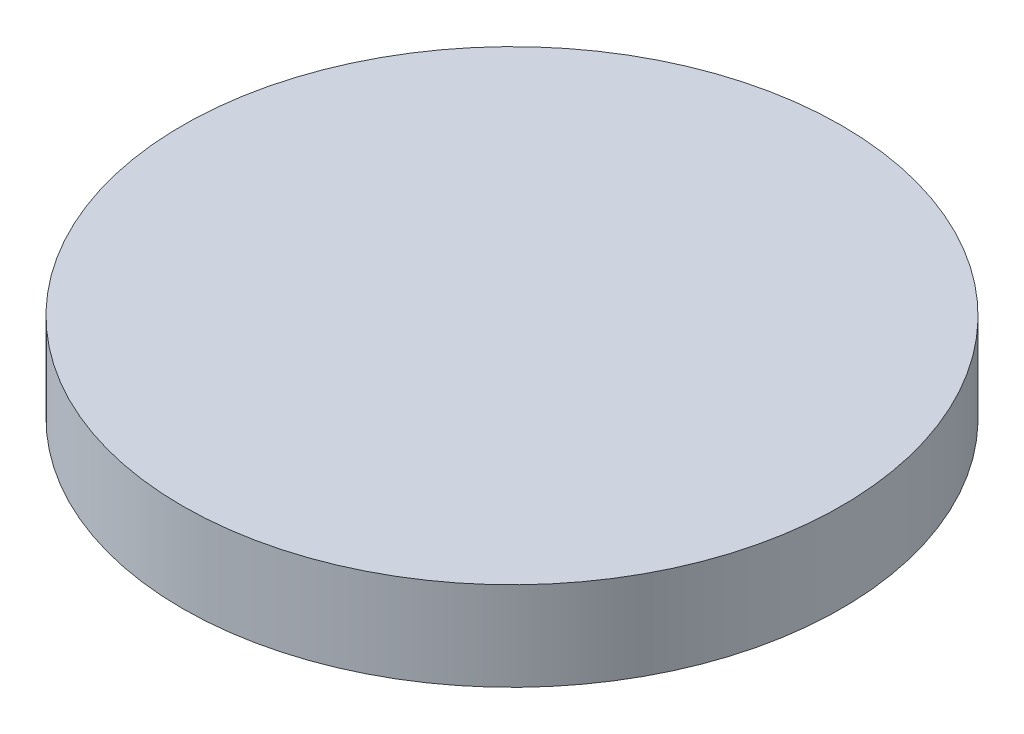
ISO-10303-21;
HEADER;
FILE_DESCRIPTION(('STEP AP214'),'2;1');
FILE_NAME('part.step','',(''),(''),'','','');
FILE_SCHEMA(('AUTOMOTIVE_DESIGN { 1 0 10303 214 1 1 1 1 }'));
ENDSEC;
DATA;
#1=APPLICATION_CONTEXT('core data for automotive mechanical design processes');
#2=APPLICATION_PROTOCOL_DEFINITION('international standard','automotive_design',2000,#1);
#3=PRODUCT_CONTEXT('',#1,'mechanical');
#4=PRODUCT('Part','Part','',(#3));
#5=PRODUCT_RELATED_PRODUCT_CATEGORY('part','',(#4));
#6=PRODUCT_DEFINITION_FORMATION('','',#4);
#7=PRODUCT_DEFINITION_CONTEXT('part definition',#1,'design');
#8=PRODUCT_DEFINITION('design','',#6,#7);
#9=PRODUCT_DEFINITION_SHAPE('','',#8);
#10=(LENGTH_UNIT() NAMED_UNIT(*) SI_UNIT(.MILLI.,.METRE.));
#11=(NAMED_UNIT(*) PLANE_ANGLE_UNIT() SI_UNIT($,.RADIAN.));
#12=(NAMED_UNIT(*) SI_UNIT($,.STERADIAN.) SOLID_ANGLE_UNIT());
#13=UNCERTAINTY_MEASURE_WITH_UNIT(LENGTH_MEASURE(1.E-05),#10,'distance_accuracy_value','');
#14=(GEOMETRIC_REPRESENTATION_CONTEXT(3) GLOBAL_UNCERTAINTY_ASSIGNED_CONTEXT((#13)) GLOBAL_UNIT_ASSIGNED_CONTEXT((#10,
#11,#12)) REPRESENTATION_CONTEXT('',''));
#15=CARTESIAN_POINT('',(0.,0.,0.));
#16=DIRECTION('',(0.,0.,1.));
#17=DIRECTION('',(1.,0.,0.));
#18=AXIS2_PLACEMENT_3D('',#15,#16,#17);
#19=CARTESIAN_POINT('',(0.,3.302,0.));
#20=DIRECTION('',(0.,-1.,0.));
#21=DIRECTION('',(0.,0.,-1.));
#22=AXIS2_PLACEMENT_3D('',#19,#20,#21);
#23=CYLINDRICAL_SURFACE('',#22,12.25);
#24=CARTESIAN_POINT('',(0.,3.302,0.));
#25=DIRECTION('',(0.,1.,0.));
#26=DIRECTION('',(0.,0.,1.));
#27=AXIS2_PLACEMENT_3D('',#24,#25,#26);
#28=CIRCLE('',#27,12.25);
#29=CARTESIAN_POINT('',(0.,3.302,12.25));
#30=VERTEX_POINT('',#29);
#31=EDGE_CURVE('E10',#30,#30,#28,.T.);
#32=ORIENTED_EDGE('',*,*,#31,.F.);
#33=EDGE_LOOP('',(#32));
#34=FACE_BOUND('',#33,.T.);
#35=CARTESIAN_POINT('',(0.,0.,0.));
#36=DIRECTION('',(0.,1.,0.));
#37=DIRECTION('',(0.,0.,1.));
#38=AXIS2_PLACEMENT_3D('',#35,#36,#37);
#39=CIRCLE('',#38,12.25);
#40=CARTESIAN_POINT('',(0.,0.,12.25));
#41=VERTEX_POINT('',#40);
#42=EDGE_CURVE('E40',#41,#41,#39,.T.);
#43=ORIENTED_EDGE('',*,*,#42,.T.);
#44=EDGE_LOOP('',(#43));
#45=FACE_BOUND('',#44,.T.);
#46=ADVANCED_FACE('F37',(#34,#45),#23,.T.);
#47=CARTESIAN_POINT('',(0.,3.302,0.));
#48=DIRECTION('',(0.,1.,0.));
#49=DIRECTION('',(0.,0.,1.));
#50=AXIS2_PLACEMENT_3D('',#47,#48,#49);
#51=PLANE('',#50);
#52=ORIENTED_EDGE('',*,*,#31,.T.);
#53=EDGE_LOOP('',(#52));
#54=FACE_BOUND('',#53,.T.);
#55=ADVANCED_FACE('F54',(#54),#51,.T.);
#56=CARTESIAN_POINT('',(0.,0.,0.));
#57=DIRECTION('',(0.,1.,0.));
#58=DIRECTION('',(0.,0.,1.));
#59=AXIS2_PLACEMENT_3D('',#56,#57,#58);
#60=PLANE('',#59);
#61=ORIENTED_EDGE('',*,*,#42,.F.);
#62=EDGE_LOOP('',(#61));
#63=FACE_BOUND('',#62,.T.);
#64=ADVANCED_FACE('F52',(#63),#60,.F.);
#65=CLOSED_SHELL('',(#46,#55,#64));
#66=MANIFOLD_SOLID_BREP('B2',#65);
#67=ADVANCED_BREP_SHAPE_REPRESENTATION('',(#18,#66),#14);
#68=SHAPE_DEFINITION_REPRESENTATION(#9,#67);
ENDSEC;
END-ISO-10303-21;
